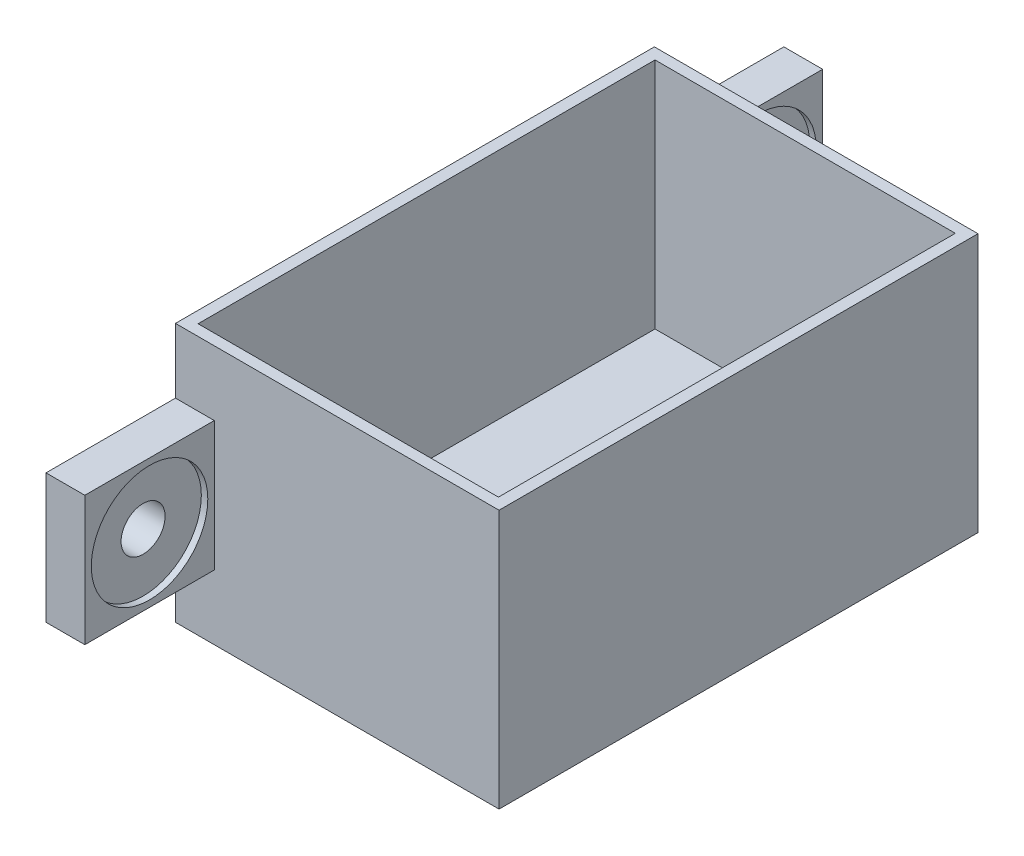
ISO-10303-21;
HEADER;
FILE_DESCRIPTION(('STEP AP214'),'2;1');
FILE_NAME('part.step','',(''),(''),'','','');
FILE_SCHEMA(('AUTOMOTIVE_DESIGN { 1 0 10303 214 1 1 1 1 }'));
ENDSEC;
DATA;
#1=APPLICATION_CONTEXT('core data for automotive mechanical design processes');
#2=APPLICATION_PROTOCOL_DEFINITION('international standard','automotive_design',2000,#1);
#3=PRODUCT_CONTEXT('',#1,'mechanical');
#4=PRODUCT('Part','Part','',(#3));
#5=PRODUCT_RELATED_PRODUCT_CATEGORY('part','',(#4));
#6=PRODUCT_DEFINITION_FORMATION('','',#4);
#7=PRODUCT_DEFINITION_CONTEXT('part definition',#1,'design');
#8=PRODUCT_DEFINITION('design','',#6,#7);
#9=PRODUCT_DEFINITION_SHAPE('','',#8);
#10=(LENGTH_UNIT() NAMED_UNIT(*) SI_UNIT(.MILLI.,.METRE.));
#11=(NAMED_UNIT(*) PLANE_ANGLE_UNIT() SI_UNIT($,.RADIAN.));
#12=(NAMED_UNIT(*) SI_UNIT($,.STERADIAN.) SOLID_ANGLE_UNIT());
#13=UNCERTAINTY_MEASURE_WITH_UNIT(LENGTH_MEASURE(1.E-05),#10,'distance_accuracy_value','');
#14=(GEOMETRIC_REPRESENTATION_CONTEXT(3) GLOBAL_UNCERTAINTY_ASSIGNED_CONTEXT((#13)) GLOBAL_UNIT_ASSIGNED_CONTEXT((#10,
#11,#12)) REPRESENTATION_CONTEXT('',''));
#15=CARTESIAN_POINT('',(0.,0.,0.));
#16=DIRECTION('',(0.,0.,1.));
#17=DIRECTION('',(1.,0.,0.));
#18=AXIS2_PLACEMENT_3D('',#15,#16,#17);
#19=CARTESIAN_POINT('',(-88.7261701767557,20.,7.55517570960751));
#20=DIRECTION('',(0.,0.,-1.));
#21=DIRECTION('',(-1.,0.,0.));
#22=AXIS2_PLACEMENT_3D('',#19,#20,#21);
#23=PLANE('',#22);
#24=DIRECTION('',(-1.,0.,0.));
#25=VECTOR('',#24,1.);
#26=CARTESIAN_POINT('',(-85.7261701767557,15.,7.55517570960751));
#27=LINE('',#26,#25);
#28=CARTESIAN_POINT('',(-85.7261701767557,15.,7.55517570960751));
#29=VERTEX_POINT('',#28);
#30=CARTESIAN_POINT('',(-88.7261701767557,15.,7.55517570960751));
#31=VERTEX_POINT('',#30);
#32=EDGE_CURVE('E178',#29,#31,#27,.T.);
#33=ORIENTED_EDGE('',*,*,#32,.F.);
#34=DIRECTION('',(0.,-1.,0.));
#35=VECTOR('',#34,1.);
#36=CARTESIAN_POINT('',(-85.7261701767557,15.,7.55517570960751));
#37=LINE('',#36,#35);
#38=CARTESIAN_POINT('',(-85.7261701767557,5.,7.55517570960751));
#39=VERTEX_POINT('',#38);
#40=EDGE_CURVE('E170',#29,#39,#37,.T.);
#41=ORIENTED_EDGE('',*,*,#40,.T.);
#42=DIRECTION('',(-1.,0.,0.));
#43=VECTOR('',#42,1.);
#44=CARTESIAN_POINT('',(-85.7261701767557,5.,7.55517570960751));
#45=LINE('',#44,#43);
#46=CARTESIAN_POINT('',(-88.7261701767557,5.,7.55517570960751));
#47=VERTEX_POINT('',#46);
#48=EDGE_CURVE('E155',#39,#47,#45,.T.);
#49=ORIENTED_EDGE('',*,*,#48,.T.);
#50=DIRECTION('',(0.,-1.,0.));
#51=VECTOR('',#50,1.);
#52=CARTESIAN_POINT('',(-88.7261701767557,20.,7.55517570960751));
#53=LINE('',#52,#51);
#54=CARTESIAN_POINT('',(-88.7261701767557,0.,7.55517570960751));
#55=VERTEX_POINT('',#54);
#56=EDGE_CURVE('E319',#47,#55,#53,.T.);
#57=ORIENTED_EDGE('',*,*,#56,.T.);
#58=DIRECTION('',(1.,0.,0.));
#59=VECTOR('',#58,1.);
#60=CARTESIAN_POINT('',(-88.7261701767557,0.,7.55517570960751));
#61=LINE('',#60,#59);
#62=CARTESIAN_POINT('',(-63.7261701767557,0.,7.55517570960751));
#63=VERTEX_POINT('',#62);
#64=EDGE_CURVE('E311',#55,#63,#61,.T.);
#65=ORIENTED_EDGE('',*,*,#64,.T.);
#66=DIRECTION('',(0.,-1.,0.));
#67=VECTOR('',#66,1.);
#68=CARTESIAN_POINT('',(-63.7261701767557,20.,7.55517570960751));
#69=LINE('',#68,#67);
#70=CARTESIAN_POINT('',(-63.7261701767557,20.,7.55517570960751));
#71=VERTEX_POINT('',#70);
#72=EDGE_CURVE('E320',#71,#63,#69,.T.);
#73=ORIENTED_EDGE('',*,*,#72,.F.);
#74=DIRECTION('',(1.,0.,0.));
#75=VECTOR('',#74,1.);
#76=CARTESIAN_POINT('',(-88.7261701767557,20.,7.55517570960751));
#77=LINE('',#76,#75);
#78=CARTESIAN_POINT('',(-88.7261701767557,20.,7.55517570960751));
#79=VERTEX_POINT('',#78);
#80=EDGE_CURVE('E297',#79,#71,#77,.T.);
#81=ORIENTED_EDGE('',*,*,#80,.F.);
#82=EDGE_CURVE('E317',#79,#31,#53,.T.);
#83=ORIENTED_EDGE('',*,*,#82,.T.);
#84=EDGE_LOOP('',(#33,#41,#49,#57,#65,#73,#81,#83));
#85=FACE_BOUND('',#84,.T.);
#86=ADVANCED_FACE('F41',(#85),#23,.F.);
#87=CARTESIAN_POINT('',(-88.7261701767557,20.,-29.4448242903925));
#88=DIRECTION('',(0.,0.,-1.));
#89=DIRECTION('',(-1.,0.,0.));
#90=AXIS2_PLACEMENT_3D('',#87,#88,#89);
#91=PLANE('',#90);
#92=DIRECTION('',(-1.,0.,0.));
#93=VECTOR('',#92,1.);
#94=CARTESIAN_POINT('',(-85.7261701767557,5.,-29.4448242903925));
#95=LINE('',#94,#93);
#96=CARTESIAN_POINT('',(-85.7261701767557,5.,-29.4448242903925));
#97=VERTEX_POINT('',#96);
#98=CARTESIAN_POINT('',(-88.7261701767557,5.,-29.4448242903925));
#99=VERTEX_POINT('',#98);
#100=EDGE_CURVE('E233',#97,#99,#95,.T.);
#101=ORIENTED_EDGE('',*,*,#100,.F.);
#102=DIRECTION('',(0.,1.,0.));
#103=VECTOR('',#102,1.);
#104=CARTESIAN_POINT('',(-85.7261701767557,15.,-29.4448242903925));
#105=LINE('',#104,#103);
#106=CARTESIAN_POINT('',(-85.7261701767557,15.,-29.4448242903925));
#107=VERTEX_POINT('',#106);
#108=EDGE_CURVE('E206',#97,#107,#105,.T.);
#109=ORIENTED_EDGE('',*,*,#108,.T.);
#110=DIRECTION('',(-1.,0.,0.));
#111=VECTOR('',#110,1.);
#112=CARTESIAN_POINT('',(-85.7261701767557,15.,-29.4448242903925));
#113=LINE('',#112,#111);
#114=CARTESIAN_POINT('',(-88.7261701767557,15.,-29.4448242903925));
#115=VERTEX_POINT('',#114);
#116=EDGE_CURVE('E223',#107,#115,#113,.T.);
#117=ORIENTED_EDGE('',*,*,#116,.T.);
#118=DIRECTION('',(0.,-1.,0.));
#119=VECTOR('',#118,1.);
#120=CARTESIAN_POINT('',(-88.7261701767557,20.,-29.4448242903925));
#121=LINE('',#120,#119);
#122=CARTESIAN_POINT('',(-88.7261701767557,20.,-29.4448242903925));
#123=VERTEX_POINT('',#122);
#124=EDGE_CURVE('E11',#123,#115,#121,.T.);
#125=ORIENTED_EDGE('',*,*,#124,.F.);
#126=DIRECTION('',(1.,0.,0.));
#127=VECTOR('',#126,1.);
#128=CARTESIAN_POINT('',(-88.7261701767557,20.,-29.4448242903925));
#129=LINE('',#128,#127);
#130=CARTESIAN_POINT('',(-63.7261701767557,20.,-29.4448242903925));
#131=VERTEX_POINT('',#130);
#132=EDGE_CURVE('E289',#123,#131,#129,.T.);
#133=ORIENTED_EDGE('',*,*,#132,.T.);
#134=DIRECTION('',(0.,-1.,0.));
#135=VECTOR('',#134,1.);
#136=CARTESIAN_POINT('',(-63.7261701767557,20.,-29.4448242903925));
#137=LINE('',#136,#135);
#138=CARTESIAN_POINT('',(-63.7261701767557,0.,-29.4448242903925));
#139=VERTEX_POINT('',#138);
#140=EDGE_CURVE('E45',#131,#139,#137,.T.);
#141=ORIENTED_EDGE('',*,*,#140,.T.);
#142=DIRECTION('',(1.,0.,0.));
#143=VECTOR('',#142,1.);
#144=CARTESIAN_POINT('',(-88.7261701767557,0.,-29.4448242903925));
#145=LINE('',#144,#143);
#146=CARTESIAN_POINT('',(-88.7261701767557,0.,-29.4448242903925));
#147=VERTEX_POINT('',#146);
#148=EDGE_CURVE('E279',#147,#139,#145,.T.);
#149=ORIENTED_EDGE('',*,*,#148,.F.);
#150=EDGE_CURVE('E51',#99,#147,#121,.T.);
#151=ORIENTED_EDGE('',*,*,#150,.F.);
#152=EDGE_LOOP('',(#101,#109,#117,#125,#133,#141,#149,#151));
#153=FACE_BOUND('',#152,.T.);
#154=ADVANCED_FACE('F43',(#153),#91,.T.);
#155=CARTESIAN_POINT('',(-88.7261701767557,20.,7.55517570960751));
#156=DIRECTION('',(-1.,0.,0.));
#157=DIRECTION('',(0.,0.,1.));
#158=AXIS2_PLACEMENT_3D('',#155,#156,#157);
#159=PLANE('',#158);
#160=CARTESIAN_POINT('',(-88.7261701767557,10.,-34.4448242903925));
#161=DIRECTION('',(1.,0.,0.));
#162=DIRECTION('',(0.,0.,-1.));
#163=AXIS2_PLACEMENT_3D('',#160,#161,#162);
#164=CIRCLE('',#163,1.7);
#165=CARTESIAN_POINT('',(-88.7261701767557,10.,-36.1448242903925));
#166=VERTEX_POINT('',#165);
#167=EDGE_CURVE('E381',#166,#166,#164,.T.);
#168=ORIENTED_EDGE('',*,*,#167,.T.);
#169=EDGE_LOOP('',(#168));
#170=FACE_BOUND('',#169,.T.);
#171=CARTESIAN_POINT('',(-88.7261701767555,10.,12.5551757096075));
#172=DIRECTION('',(1.,0.,0.));
#173=DIRECTION('',(0.,0.,-1.));
#174=AXIS2_PLACEMENT_3D('',#171,#172,#173);
#175=CIRCLE('',#174,1.7);
#176=CARTESIAN_POINT('',(-88.7261701767555,10.,10.8551757096075));
#177=VERTEX_POINT('',#176);
#178=EDGE_CURVE('E187',#177,#177,#175,.T.);
#179=ORIENTED_EDGE('',*,*,#178,.T.);
#180=EDGE_LOOP('',(#179));
#181=FACE_BOUND('',#180,.T.);
#182=DIRECTION('',(0.,0.,-1.));
#183=VECTOR('',#182,1.);
#184=CARTESIAN_POINT('',(-88.7261701767557,0.,7.55517570960751));
#185=LINE('',#184,#183);
#186=EDGE_CURVE('E294',#55,#147,#185,.T.);
#187=ORIENTED_EDGE('',*,*,#186,.F.);
#188=ORIENTED_EDGE('',*,*,#56,.F.);
#189=DIRECTION('',(0.,0.,1.));
#190=VECTOR('',#189,1.);
#191=CARTESIAN_POINT('',(-88.7261701767557,5.,7.55517570960751));
#192=LINE('',#191,#190);
#193=CARTESIAN_POINT('',(-88.7261701767557,5.,17.5551757096075));
#194=VERTEX_POINT('',#193);
#195=EDGE_CURVE('E59',#47,#194,#192,.T.);
#196=ORIENTED_EDGE('',*,*,#195,.T.);
#197=DIRECTION('',(0.,1.,0.));
#198=VECTOR('',#197,1.);
#199=CARTESIAN_POINT('',(-88.7261701767557,15.,17.5551757096075));
#200=LINE('',#199,#198);
#201=CARTESIAN_POINT('',(-88.7261701767557,15.,17.5551757096075));
#202=VERTEX_POINT('',#201);
#203=EDGE_CURVE('E184',#194,#202,#200,.T.);
#204=ORIENTED_EDGE('',*,*,#203,.T.);
#205=DIRECTION('',(0.,0.,-1.));
#206=VECTOR('',#205,1.);
#207=CARTESIAN_POINT('',(-88.7261701767557,15.,7.55517570960751));
#208=LINE('',#207,#206);
#209=EDGE_CURVE('E180',#202,#31,#208,.T.);
#210=ORIENTED_EDGE('',*,*,#209,.T.);
#211=ORIENTED_EDGE('',*,*,#82,.F.);
#212=DIRECTION('',(0.,0.,-1.));
#213=VECTOR('',#212,1.);
#214=CARTESIAN_POINT('',(-88.7261701767557,20.,7.55517570960751));
#215=LINE('',#214,#213);
#216=EDGE_CURVE('E300',#79,#123,#215,.T.);
#217=ORIENTED_EDGE('',*,*,#216,.T.);
#218=ORIENTED_EDGE('',*,*,#124,.T.);
#219=DIRECTION('',(0.,0.,-1.));
#220=VECTOR('',#219,1.);
#221=CARTESIAN_POINT('',(-88.7261701767557,15.,-29.4448242903925));
#222=LINE('',#221,#220);
#223=CARTESIAN_POINT('',(-88.7261701767557,15.,-39.4448242903925));
#224=VERTEX_POINT('',#223);
#225=EDGE_CURVE('E67',#115,#224,#222,.T.);
#226=ORIENTED_EDGE('',*,*,#225,.T.);
#227=DIRECTION('',(0.,-1.,0.));
#228=VECTOR('',#227,1.);
#229=CARTESIAN_POINT('',(-88.7261701767557,15.,-39.4448242903925));
#230=LINE('',#229,#228);
#231=CARTESIAN_POINT('',(-88.7261701767557,5.,-39.4448242903925));
#232=VERTEX_POINT('',#231);
#233=EDGE_CURVE('E226',#224,#232,#230,.T.);
#234=ORIENTED_EDGE('',*,*,#233,.T.);
#235=DIRECTION('',(0.,0.,1.));
#236=VECTOR('',#235,1.);
#237=CARTESIAN_POINT('',(-88.7261701767557,5.,-29.4448242903925));
#238=LINE('',#237,#236);
#239=EDGE_CURVE('E211',#232,#99,#238,.T.);
#240=ORIENTED_EDGE('',*,*,#239,.T.);
#241=ORIENTED_EDGE('',*,*,#150,.T.);
#242=EDGE_LOOP('',(#187,#188,#196,#204,#210,#211,#217,#218,#226,#234,#240,#241));
#243=FACE_BOUND('',#242,.T.);
#244=ADVANCED_FACE('F341',(#170,#181,#243),#159,.T.);
#245=CARTESIAN_POINT('',(-63.7261701767557,20.,7.55517570960751));
#246=DIRECTION('',(-1.,0.,0.));
#247=DIRECTION('',(0.,0.,1.));
#248=AXIS2_PLACEMENT_3D('',#245,#246,#247);
#249=PLANE('',#248);
#250=DIRECTION('',(0.,0.,-1.));
#251=VECTOR('',#250,1.);
#252=CARTESIAN_POINT('',(-63.7261701767557,0.,7.55517570960751));
#253=LINE('',#252,#251);
#254=EDGE_CURVE('E307',#63,#139,#253,.T.);
#255=ORIENTED_EDGE('',*,*,#254,.T.);
#256=ORIENTED_EDGE('',*,*,#140,.F.);
#257=DIRECTION('',(0.,0.,-1.));
#258=VECTOR('',#257,1.);
#259=CARTESIAN_POINT('',(-63.7261701767557,20.,7.55517570960751));
#260=LINE('',#259,#258);
#261=EDGE_CURVE('E293',#71,#131,#260,.T.);
#262=ORIENTED_EDGE('',*,*,#261,.F.);
#263=ORIENTED_EDGE('',*,*,#72,.T.);
#264=EDGE_LOOP('',(#255,#256,#262,#263));
#265=FACE_BOUND('',#264,.T.);
#266=ADVANCED_FACE('F335',(#265),#249,.F.);
#267=CARTESIAN_POINT('',(0.,20.,0.));
#268=DIRECTION('',(0.,1.,0.));
#269=DIRECTION('',(0.,0.,1.));
#270=AXIS2_PLACEMENT_3D('',#267,#268,#269);
#271=PLANE('',#270);
#272=DIRECTION('',(0.,0.,1.));
#273=VECTOR('',#272,1.);
#274=CARTESIAN_POINT('',(-87.8261701767557,20.,-28.5948242903925));
#275=LINE('',#274,#273);
#276=CARTESIAN_POINT('',(-87.8261701767557,20.,-28.5948242903925));
#277=VERTEX_POINT('',#276);
#278=CARTESIAN_POINT('',(-87.8261701767557,20.,6.70517570960751));
#279=VERTEX_POINT('',#278);
#280=EDGE_CURVE('E236',#277,#279,#275,.T.);
#281=ORIENTED_EDGE('',*,*,#280,.F.);
#282=DIRECTION('',(-1.,0.,0.));
#283=VECTOR('',#282,1.);
#284=CARTESIAN_POINT('',(-87.8261701767557,20.,-28.5948242903925));
#285=LINE('',#284,#283);
#286=CARTESIAN_POINT('',(-64.6261701767557,20.,-28.5948242903925));
#287=VERTEX_POINT('',#286);
#288=EDGE_CURVE('E250',#287,#277,#285,.T.);
#289=ORIENTED_EDGE('',*,*,#288,.F.);
#290=DIRECTION('',(0.,0.,-1.));
#291=VECTOR('',#290,1.);
#292=CARTESIAN_POINT('',(-64.6261701767557,20.,-28.5948242903925));
#293=LINE('',#292,#291);
#294=CARTESIAN_POINT('',(-64.6261701767557,20.,6.70517570960751));
#295=VERTEX_POINT('',#294);
#296=EDGE_CURVE('E269',#295,#287,#293,.T.);
#297=ORIENTED_EDGE('',*,*,#296,.F.);
#298=DIRECTION('',(1.,0.,0.));
#299=VECTOR('',#298,1.);
#300=CARTESIAN_POINT('',(-87.8261701767557,20.,6.70517570960751));
#301=LINE('',#300,#299);
#302=EDGE_CURVE('E265',#279,#295,#301,.T.);
#303=ORIENTED_EDGE('',*,*,#302,.F.);
#304=EDGE_LOOP('',(#281,#289,#297,#303));
#305=FACE_BOUND('',#304,.T.);
#306=ORIENTED_EDGE('',*,*,#132,.F.);
#307=ORIENTED_EDGE('',*,*,#216,.F.);
#308=ORIENTED_EDGE('',*,*,#80,.T.);
#309=ORIENTED_EDGE('',*,*,#261,.T.);
#310=EDGE_LOOP('',(#306,#307,#308,#309));
#311=FACE_BOUND('',#310,.T.);
#312=ADVANCED_FACE('F356',(#305,#311),#271,.T.);
#313=CARTESIAN_POINT('',(0.,0.,0.));
#314=DIRECTION('',(0.,1.,0.));
#315=DIRECTION('',(0.,0.,1.));
#316=AXIS2_PLACEMENT_3D('',#313,#314,#315);
#317=PLANE('',#316);
#318=ORIENTED_EDGE('',*,*,#148,.T.);
#319=ORIENTED_EDGE('',*,*,#254,.F.);
#320=ORIENTED_EDGE('',*,*,#64,.F.);
#321=ORIENTED_EDGE('',*,*,#186,.T.);
#322=EDGE_LOOP('',(#318,#319,#320,#321));
#323=FACE_BOUND('',#322,.T.);
#324=ADVANCED_FACE('F338',(#323),#317,.F.);
#325=CARTESIAN_POINT('',(-87.8261701767557,2.,-28.5948242903925));
#326=DIRECTION('',(-1.,0.,0.));
#327=DIRECTION('',(0.,0.,1.));
#328=AXIS2_PLACEMENT_3D('',#325,#326,#327);
#329=PLANE('',#328);
#330=ORIENTED_EDGE('',*,*,#280,.T.);
#331=DIRECTION('',(0.,1.,0.));
#332=VECTOR('',#331,1.);
#333=CARTESIAN_POINT('',(-87.8261701767557,2.,6.70517570960751));
#334=LINE('',#333,#332);
#335=CARTESIAN_POINT('',(-87.8261701767557,2.,6.70517570960751));
#336=VERTEX_POINT('',#335);
#337=EDGE_CURVE('E262',#336,#279,#334,.T.);
#338=ORIENTED_EDGE('',*,*,#337,.F.);
#339=DIRECTION('',(0.,0.,1.));
#340=VECTOR('',#339,1.);
#341=CARTESIAN_POINT('',(-87.8261701767557,2.,-28.5948242903925));
#342=LINE('',#341,#340);
#343=CARTESIAN_POINT('',(-87.8261701767557,2.,-28.5948242903925));
#344=VERTEX_POINT('',#343);
#345=EDGE_CURVE('E245',#344,#336,#342,.T.);
#346=ORIENTED_EDGE('',*,*,#345,.F.);
#347=DIRECTION('',(0.,1.,0.));
#348=VECTOR('',#347,1.);
#349=CARTESIAN_POINT('',(-87.8261701767557,2.,-28.5948242903925));
#350=LINE('',#349,#348);
#351=EDGE_CURVE('E276',#344,#277,#350,.T.);
#352=ORIENTED_EDGE('',*,*,#351,.T.);
#353=EDGE_LOOP('',(#330,#338,#346,#352));
#354=FACE_BOUND('',#353,.T.);
#355=ADVANCED_FACE('F364',(#354),#329,.F.);
#356=CARTESIAN_POINT('',(-87.8261701767557,2.,-28.5948242903925));
#357=DIRECTION('',(0.,0.,-1.));
#358=DIRECTION('',(-1.,0.,0.));
#359=AXIS2_PLACEMENT_3D('',#356,#357,#358);
#360=PLANE('',#359);
#361=ORIENTED_EDGE('',*,*,#288,.T.);
#362=ORIENTED_EDGE('',*,*,#351,.F.);
#363=DIRECTION('',(-1.,0.,0.));
#364=VECTOR('',#363,1.);
#365=CARTESIAN_POINT('',(-87.8261701767557,2.,-28.5948242903925));
#366=LINE('',#365,#364);
#367=CARTESIAN_POINT('',(-64.6261701767557,2.,-28.5948242903925));
#368=VERTEX_POINT('',#367);
#369=EDGE_CURVE('E258',#368,#344,#366,.T.);
#370=ORIENTED_EDGE('',*,*,#369,.F.);
#371=DIRECTION('',(0.,1.,0.));
#372=VECTOR('',#371,1.);
#373=CARTESIAN_POINT('',(-64.6261701767557,2.,-28.5948242903925));
#374=LINE('',#373,#372);
#375=EDGE_CURVE('E280',#368,#287,#374,.T.);
#376=ORIENTED_EDGE('',*,*,#375,.T.);
#377=EDGE_LOOP('',(#361,#362,#370,#376));
#378=FACE_BOUND('',#377,.T.);
#379=ADVANCED_FACE('F442',(#378),#360,.F.);
#380=CARTESIAN_POINT('',(-64.6261701767557,2.,-28.5948242903925));
#381=DIRECTION('',(1.,0.,0.));
#382=DIRECTION('',(0.,0.,-1.));
#383=AXIS2_PLACEMENT_3D('',#380,#381,#382);
#384=PLANE('',#383);
#385=ORIENTED_EDGE('',*,*,#296,.T.);
#386=ORIENTED_EDGE('',*,*,#375,.F.);
#387=DIRECTION('',(0.,0.,-1.));
#388=VECTOR('',#387,1.);
#389=CARTESIAN_POINT('',(-64.6261701767557,2.,-28.5948242903925));
#390=LINE('',#389,#388);
#391=CARTESIAN_POINT('',(-64.6261701767557,2.,6.70517570960751));
#392=VERTEX_POINT('',#391);
#393=EDGE_CURVE('E254',#392,#368,#390,.T.);
#394=ORIENTED_EDGE('',*,*,#393,.F.);
#395=DIRECTION('',(0.,1.,0.));
#396=VECTOR('',#395,1.);
#397=CARTESIAN_POINT('',(-64.6261701767557,2.,6.70517570960751));
#398=LINE('',#397,#396);
#399=EDGE_CURVE('E283',#392,#295,#398,.T.);
#400=ORIENTED_EDGE('',*,*,#399,.T.);
#401=EDGE_LOOP('',(#385,#386,#394,#400));
#402=FACE_BOUND('',#401,.T.);
#403=ADVANCED_FACE('F445',(#402),#384,.F.);
#404=CARTESIAN_POINT('',(-87.8261701767557,2.,6.70517570960751));
#405=DIRECTION('',(0.,0.,1.));
#406=DIRECTION('',(1.,0.,0.));
#407=AXIS2_PLACEMENT_3D('',#404,#405,#406);
#408=PLANE('',#407);
#409=ORIENTED_EDGE('',*,*,#302,.T.);
#410=ORIENTED_EDGE('',*,*,#399,.F.);
#411=DIRECTION('',(1.,0.,0.));
#412=VECTOR('',#411,1.);
#413=CARTESIAN_POINT('',(-87.8261701767557,2.,6.70517570960751));
#414=LINE('',#413,#412);
#415=EDGE_CURVE('E249',#336,#392,#414,.T.);
#416=ORIENTED_EDGE('',*,*,#415,.F.);
#417=ORIENTED_EDGE('',*,*,#337,.T.);
#418=EDGE_LOOP('',(#409,#410,#416,#417));
#419=FACE_BOUND('',#418,.T.);
#420=ADVANCED_FACE('F440',(#419),#408,.F.);
#421=CARTESIAN_POINT('',(0.,2.,0.));
#422=DIRECTION('',(0.,1.,0.));
#423=DIRECTION('',(0.,0.,1.));
#424=AXIS2_PLACEMENT_3D('',#421,#422,#423);
#425=PLANE('',#424);
#426=ORIENTED_EDGE('',*,*,#345,.T.);
#427=ORIENTED_EDGE('',*,*,#415,.T.);
#428=ORIENTED_EDGE('',*,*,#393,.T.);
#429=ORIENTED_EDGE('',*,*,#369,.T.);
#430=EDGE_LOOP('',(#426,#427,#428,#429));
#431=FACE_BOUND('',#430,.T.);
#432=ADVANCED_FACE('F434',(#431),#425,.T.);
#433=CARTESIAN_POINT('',(-85.7261701767557,5.,-29.4448242903925));
#434=DIRECTION('',(0.,-1.,0.));
#435=DIRECTION('',(0.,0.,-1.));
#436=AXIS2_PLACEMENT_3D('',#433,#434,#435);
#437=PLANE('',#436);
#438=ORIENTED_EDGE('',*,*,#239,.F.);
#439=DIRECTION('',(-1.,0.,0.));
#440=VECTOR('',#439,1.);
#441=CARTESIAN_POINT('',(-85.7261701767557,5.,-39.4448242903925));
#442=LINE('',#441,#440);
#443=CARTESIAN_POINT('',(-85.7261701767557,5.,-39.4448242903925));
#444=VERTEX_POINT('',#443);
#445=EDGE_CURVE('E237',#444,#232,#442,.T.);
#446=ORIENTED_EDGE('',*,*,#445,.F.);
#447=DIRECTION('',(0.,0.,1.));
#448=VECTOR('',#447,1.);
#449=CARTESIAN_POINT('',(-85.7261701767557,5.,-29.4448242903925));
#450=LINE('',#449,#448);
#451=EDGE_CURVE('E219',#444,#97,#450,.T.);
#452=ORIENTED_EDGE('',*,*,#451,.T.);
#453=ORIENTED_EDGE('',*,*,#100,.T.);
#454=EDGE_LOOP('',(#438,#446,#452,#453));
#455=FACE_BOUND('',#454,.T.);
#456=ADVANCED_FACE('F345',(#455),#437,.T.);
#457=CARTESIAN_POINT('',(-85.7261701767557,15.,-39.4448242903925));
#458=DIRECTION('',(0.,0.,-1.));
#459=DIRECTION('',(-1.,0.,0.));
#460=AXIS2_PLACEMENT_3D('',#457,#458,#459);
#461=PLANE('',#460);
#462=ORIENTED_EDGE('',*,*,#233,.F.);
#463=DIRECTION('',(-1.,0.,0.));
#464=VECTOR('',#463,1.);
#465=CARTESIAN_POINT('',(-85.7261701767557,15.,-39.4448242903925));
#466=LINE('',#465,#464);
#467=CARTESIAN_POINT('',(-85.7261701767557,15.,-39.4448242903925));
#468=VERTEX_POINT('',#467);
#469=EDGE_CURVE('E240',#468,#224,#466,.T.);
#470=ORIENTED_EDGE('',*,*,#469,.F.);
#471=DIRECTION('',(0.,-1.,0.));
#472=VECTOR('',#471,1.);
#473=CARTESIAN_POINT('',(-85.7261701767557,15.,-39.4448242903925));
#474=LINE('',#473,#472);
#475=EDGE_CURVE('E215',#468,#444,#474,.T.);
#476=ORIENTED_EDGE('',*,*,#475,.T.);
#477=ORIENTED_EDGE('',*,*,#445,.T.);
#478=EDGE_LOOP('',(#462,#470,#476,#477));
#479=FACE_BOUND('',#478,.T.);
#480=ADVANCED_FACE('F427',(#479),#461,.T.);
#481=CARTESIAN_POINT('',(-85.7261701767557,15.,-29.4448242903925));
#482=DIRECTION('',(0.,1.,0.));
#483=DIRECTION('',(0.,0.,1.));
#484=AXIS2_PLACEMENT_3D('',#481,#482,#483);
#485=PLANE('',#484);
#486=ORIENTED_EDGE('',*,*,#225,.F.);
#487=ORIENTED_EDGE('',*,*,#116,.F.);
#488=DIRECTION('',(0.,0.,-1.));
#489=VECTOR('',#488,1.);
#490=CARTESIAN_POINT('',(-85.7261701767557,15.,-29.4448242903925));
#491=LINE('',#490,#489);
#492=EDGE_CURVE('E210',#107,#468,#491,.T.);
#493=ORIENTED_EDGE('',*,*,#492,.T.);
#494=ORIENTED_EDGE('',*,*,#469,.T.);
#495=EDGE_LOOP('',(#486,#487,#493,#494));
#496=FACE_BOUND('',#495,.T.);
#497=ADVANCED_FACE('F351',(#496),#485,.T.);
#498=CARTESIAN_POINT('',(-85.7261701767557,0.,0.));
#499=DIRECTION('',(1.,0.,0.));
#500=DIRECTION('',(0.,0.,-1.));
#501=AXIS2_PLACEMENT_3D('',#498,#499,#500);
#502=PLANE('',#501);
#503=CARTESIAN_POINT('',(-85.7261701767557,10.,-34.4448242903925));
#504=DIRECTION('',(1.,0.,0.));
#505=DIRECTION('',(0.,0.,-1.));
#506=AXIS2_PLACEMENT_3D('',#503,#504,#505);
#507=CIRCLE('',#506,4.49999999999999);
#508=CARTESIAN_POINT('',(-85.7261701767557,10.,-38.9448242903925));
#509=VERTEX_POINT('',#508);
#510=EDGE_CURVE('E410',#509,#509,#507,.T.);
#511=ORIENTED_EDGE('',*,*,#510,.F.);
#512=EDGE_LOOP('',(#511));
#513=FACE_BOUND('',#512,.T.);
#514=ORIENTED_EDGE('',*,*,#108,.F.);
#515=ORIENTED_EDGE('',*,*,#451,.F.);
#516=ORIENTED_EDGE('',*,*,#475,.F.);
#517=ORIENTED_EDGE('',*,*,#492,.F.);
#518=EDGE_LOOP('',(#514,#515,#516,#517));
#519=FACE_BOUND('',#518,.T.);
#520=ADVANCED_FACE('F349',(#513,#519),#502,.T.);
#521=CARTESIAN_POINT('',(-85.7261701767557,15.,7.55517570960751));
#522=DIRECTION('',(0.,1.,0.));
#523=DIRECTION('',(0.,0.,1.));
#524=AXIS2_PLACEMENT_3D('',#521,#522,#523);
#525=PLANE('',#524);
#526=ORIENTED_EDGE('',*,*,#209,.F.);
#527=DIRECTION('',(-1.,0.,0.));
#528=VECTOR('',#527,1.);
#529=CARTESIAN_POINT('',(-85.7261701767557,15.,17.5551757096075));
#530=LINE('',#529,#528);
#531=CARTESIAN_POINT('',(-85.7261701767557,15.,17.5551757096075));
#532=VERTEX_POINT('',#531);
#533=EDGE_CURVE('E201',#532,#202,#530,.T.);
#534=ORIENTED_EDGE('',*,*,#533,.F.);
#535=DIRECTION('',(0.,0.,-1.));
#536=VECTOR('',#535,1.);
#537=CARTESIAN_POINT('',(-85.7261701767557,15.,7.55517570960751));
#538=LINE('',#537,#536);
#539=EDGE_CURVE('E164',#532,#29,#538,.T.);
#540=ORIENTED_EDGE('',*,*,#539,.T.);
#541=ORIENTED_EDGE('',*,*,#32,.T.);
#542=EDGE_LOOP('',(#526,#534,#540,#541));
#543=FACE_BOUND('',#542,.T.);
#544=ADVANCED_FACE('F418',(#543),#525,.T.);
#545=CARTESIAN_POINT('',(-85.7261701767557,15.,17.5551757096075));
#546=DIRECTION('',(0.,0.,1.));
#547=DIRECTION('',(0.,-1.,0.));
#548=AXIS2_PLACEMENT_3D('',#545,#546,#547);
#549=PLANE('',#548);
#550=ORIENTED_EDGE('',*,*,#203,.F.);
#551=DIRECTION('',(-1.,0.,0.));
#552=VECTOR('',#551,1.);
#553=CARTESIAN_POINT('',(-85.7261701767557,5.,17.5551757096075));
#554=LINE('',#553,#552);
#555=CARTESIAN_POINT('',(-85.7261701767557,5.,17.5551757096075));
#556=VERTEX_POINT('',#555);
#557=EDGE_CURVE('E163',#556,#194,#554,.T.);
#558=ORIENTED_EDGE('',*,*,#557,.F.);
#559=DIRECTION('',(0.,1.,0.));
#560=VECTOR('',#559,1.);
#561=CARTESIAN_POINT('',(-85.7261701767557,15.,17.5551757096075));
#562=LINE('',#561,#560);
#563=EDGE_CURVE('E173',#556,#532,#562,.T.);
#564=ORIENTED_EDGE('',*,*,#563,.T.);
#565=ORIENTED_EDGE('',*,*,#533,.T.);
#566=EDGE_LOOP('',(#550,#558,#564,#565));
#567=FACE_BOUND('',#566,.T.);
#568=ADVANCED_FACE('F424',(#567),#549,.T.);
#569=CARTESIAN_POINT('',(-85.7261701767557,5.,7.55517570960751));
#570=DIRECTION('',(0.,-1.,0.));
#571=DIRECTION('',(0.,0.,-1.));
#572=AXIS2_PLACEMENT_3D('',#569,#570,#571);
#573=PLANE('',#572);
#574=ORIENTED_EDGE('',*,*,#195,.F.);
#575=ORIENTED_EDGE('',*,*,#48,.F.);
#576=DIRECTION('',(0.,0.,1.));
#577=VECTOR('',#576,1.);
#578=CARTESIAN_POINT('',(-85.7261701767557,5.,7.55517570960751));
#579=LINE('',#578,#577);
#580=EDGE_CURVE('E158',#39,#556,#579,.T.);
#581=ORIENTED_EDGE('',*,*,#580,.T.);
#582=ORIENTED_EDGE('',*,*,#557,.T.);
#583=EDGE_LOOP('',(#574,#575,#581,#582));
#584=FACE_BOUND('',#583,.T.);
#585=ADVANCED_FACE('F157',(#584),#573,.T.);
#586=CARTESIAN_POINT('',(-85.7261701767557,0.,0.));
#587=DIRECTION('',(-1.,0.,0.));
#588=DIRECTION('',(0.,0.,1.));
#589=AXIS2_PLACEMENT_3D('',#586,#587,#588);
#590=PLANE('',#589);
#591=CARTESIAN_POINT('',(-85.7261701767555,10.,12.5551757096075));
#592=DIRECTION('',(1.,0.,0.));
#593=DIRECTION('',(0.,0.,-1.));
#594=AXIS2_PLACEMENT_3D('',#591,#592,#593);
#595=CIRCLE('',#594,4.49999999999999);
#596=CARTESIAN_POINT('',(-85.7261701767555,10.,8.05517570960753));
#597=VERTEX_POINT('',#596);
#598=EDGE_CURVE('E394',#597,#597,#595,.T.);
#599=ORIENTED_EDGE('',*,*,#598,.F.);
#600=EDGE_LOOP('',(#599));
#601=FACE_BOUND('',#600,.T.);
#602=ORIENTED_EDGE('',*,*,#40,.F.);
#603=ORIENTED_EDGE('',*,*,#539,.F.);
#604=ORIENTED_EDGE('',*,*,#563,.F.);
#605=ORIENTED_EDGE('',*,*,#580,.F.);
#606=EDGE_LOOP('',(#602,#603,#604,#605));
#607=FACE_BOUND('',#606,.T.);
#608=ADVANCED_FACE('F168',(#601,#607),#590,.F.);
#609=CARTESIAN_POINT('',(-85.7261701767555,10.,12.5551757096075));
#610=DIRECTION('',(1.,0.,0.));
#611=DIRECTION('',(0.,0.,-1.));
#612=AXIS2_PLACEMENT_3D('',#609,#610,#611);
#613=CYLINDRICAL_SURFACE('',#612,1.70000000000001);
#614=ORIENTED_EDGE('',*,*,#178,.F.);
#615=EDGE_LOOP('',(#614));
#616=FACE_BOUND('',#615,.T.);
#617=CARTESIAN_POINT('',(-86.2261701767555,10.,12.5551757096075));
#618=DIRECTION('',(1.,0.,0.));
#619=DIRECTION('',(0.,0.,-1.));
#620=AXIS2_PLACEMENT_3D('',#617,#618,#619);
#621=CIRCLE('',#620,1.70000000000001);
#622=CARTESIAN_POINT('',(-86.2261701767555,10.,10.8551757096075));
#623=VERTEX_POINT('',#622);
#624=EDGE_CURVE('E386',#623,#623,#621,.T.);
#625=ORIENTED_EDGE('',*,*,#624,.T.);
#626=EDGE_LOOP('',(#625));
#627=FACE_BOUND('',#626,.T.);
#628=ADVANCED_FACE('F518',(#616,#627),#613,.F.);
#629=CARTESIAN_POINT('',(-86.2261701767555,11.7,12.5551757096075));
#630=DIRECTION('',(-1.,0.,0.));
#631=DIRECTION('',(0.,0.,1.));
#632=AXIS2_PLACEMENT_3D('',#629,#630,#631);
#633=PLANE('',#632);
#634=ORIENTED_EDGE('',*,*,#624,.F.);
#635=EDGE_LOOP('',(#634));
#636=FACE_BOUND('',#635,.T.);
#637=CARTESIAN_POINT('',(-86.2261701767555,10.,12.5551757096075));
#638=DIRECTION('',(1.,0.,0.));
#639=DIRECTION('',(0.,0.,-1.));
#640=AXIS2_PLACEMENT_3D('',#637,#638,#639);
#641=CIRCLE('',#640,4.49999999999999);
#642=CARTESIAN_POINT('',(-86.2261701767555,10.,8.05517570960753));
#643=VERTEX_POINT('',#642);
#644=EDGE_CURVE('E389',#643,#643,#641,.T.);
#645=ORIENTED_EDGE('',*,*,#644,.T.);
#646=EDGE_LOOP('',(#645));
#647=FACE_BOUND('',#646,.T.);
#648=ADVANCED_FACE('F528',(#636,#647),#633,.F.);
#649=CARTESIAN_POINT('',(-85.7261701767555,10.,12.5551757096075));
#650=DIRECTION('',(1.,0.,0.));
#651=DIRECTION('',(0.,0.,-1.));
#652=AXIS2_PLACEMENT_3D('',#649,#650,#651);
#653=CYLINDRICAL_SURFACE('',#652,4.49999999999999);
#654=ORIENTED_EDGE('',*,*,#644,.F.);
#655=EDGE_LOOP('',(#654));
#656=FACE_BOUND('',#655,.T.);
#657=ORIENTED_EDGE('',*,*,#598,.T.);
#658=EDGE_LOOP('',(#657));
#659=FACE_BOUND('',#658,.T.);
#660=ADVANCED_FACE('F535',(#656,#659),#653,.F.);
#661=CARTESIAN_POINT('',(-85.7261701767557,10.,-34.4448242903925));
#662=DIRECTION('',(1.,0.,0.));
#663=DIRECTION('',(0.,0.,-1.));
#664=AXIS2_PLACEMENT_3D('',#661,#662,#663);
#665=CYLINDRICAL_SURFACE('',#664,1.70000000000001);
#666=ORIENTED_EDGE('',*,*,#167,.F.);
#667=EDGE_LOOP('',(#666));
#668=FACE_BOUND('',#667,.T.);
#669=CARTESIAN_POINT('',(-86.2261701767557,10.,-34.4448242903925));
#670=DIRECTION('',(1.,0.,0.));
#671=DIRECTION('',(0.,0.,-1.));
#672=AXIS2_PLACEMENT_3D('',#669,#670,#671);
#673=CIRCLE('',#672,1.70000000000001);
#674=CARTESIAN_POINT('',(-86.2261701767557,10.,-36.1448242903925));
#675=VERTEX_POINT('',#674);
#676=EDGE_CURVE('E402',#675,#675,#673,.T.);
#677=ORIENTED_EDGE('',*,*,#676,.T.);
#678=EDGE_LOOP('',(#677));
#679=FACE_BOUND('',#678,.T.);
#680=ADVANCED_FACE('F543',(#668,#679),#665,.F.);
#681=CARTESIAN_POINT('',(-86.2261701767557,11.7,-34.4448242903925));
#682=DIRECTION('',(-1.,0.,0.));
#683=DIRECTION('',(0.,0.,1.));
#684=AXIS2_PLACEMENT_3D('',#681,#682,#683);
#685=PLANE('',#684);
#686=ORIENTED_EDGE('',*,*,#676,.F.);
#687=EDGE_LOOP('',(#686));
#688=FACE_BOUND('',#687,.T.);
#689=CARTESIAN_POINT('',(-86.2261701767557,10.,-34.4448242903925));
#690=DIRECTION('',(1.,0.,0.));
#691=DIRECTION('',(0.,0.,-1.));
#692=AXIS2_PLACEMENT_3D('',#689,#690,#691);
#693=CIRCLE('',#692,4.49999999999999);
#694=CARTESIAN_POINT('',(-86.2261701767557,10.,-38.9448242903925));
#695=VERTEX_POINT('',#694);
#696=EDGE_CURVE('E406',#695,#695,#693,.T.);
#697=ORIENTED_EDGE('',*,*,#696,.T.);
#698=EDGE_LOOP('',(#697));
#699=FACE_BOUND('',#698,.T.);
#700=ADVANCED_FACE('F551',(#688,#699),#685,.F.);
#701=CARTESIAN_POINT('',(-85.7261701767557,10.,-34.4448242903925));
#702=DIRECTION('',(1.,0.,0.));
#703=DIRECTION('',(0.,0.,-1.));
#704=AXIS2_PLACEMENT_3D('',#701,#702,#703);
#705=CYLINDRICAL_SURFACE('',#704,4.49999999999999);
#706=ORIENTED_EDGE('',*,*,#696,.F.);
#707=EDGE_LOOP('',(#706));
#708=FACE_BOUND('',#707,.T.);
#709=ORIENTED_EDGE('',*,*,#510,.T.);
#710=EDGE_LOOP('',(#709));
#711=FACE_BOUND('',#710,.T.);
#712=ADVANCED_FACE('F415',(#708,#711),#705,.F.);
#713=CLOSED_SHELL('',(#86,#154,#244,#266,#312,#324,#355,#379,#403,#420,#432,#456,#480,#497,#520,
#544,#568,#585,#608,#628,#648,#660,#680,#700,#712));
#714=MANIFOLD_SOLID_BREP('B2',#713);
#715=ADVANCED_BREP_SHAPE_REPRESENTATION('',(#18,#714),#14);
#716=SHAPE_DEFINITION_REPRESENTATION(#9,#715);
ENDSEC;
END-ISO-10303-21;
